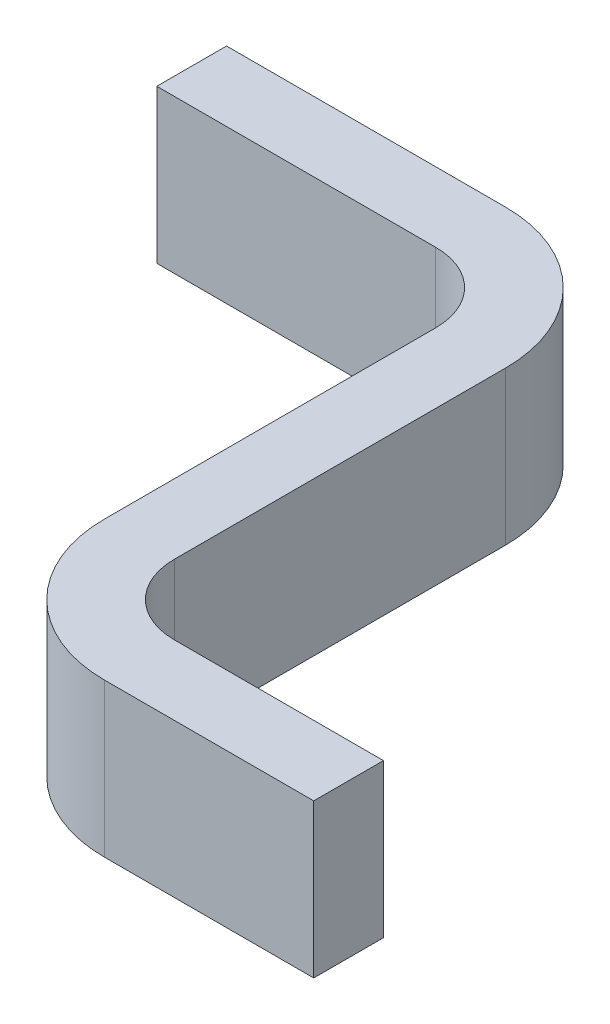
ISO-10303-21;
HEADER;
FILE_DESCRIPTION(('STEP AP214'),'2;1');
FILE_NAME('part.step','',(''),(''),'','','');
FILE_SCHEMA(('AUTOMOTIVE_DESIGN { 1 0 10303 214 1 1 1 1 }'));
ENDSEC;
DATA;
#1=APPLICATION_CONTEXT('core data for automotive mechanical design processes');
#2=APPLICATION_PROTOCOL_DEFINITION('international standard','automotive_design',2000,#1);
#3=PRODUCT_CONTEXT('',#1,'mechanical');
#4=PRODUCT('Part','Part','',(#3));
#5=PRODUCT_RELATED_PRODUCT_CATEGORY('part','',(#4));
#6=PRODUCT_DEFINITION_FORMATION('','',#4);
#7=PRODUCT_DEFINITION_CONTEXT('part definition',#1,'design');
#8=PRODUCT_DEFINITION('design','',#6,#7);
#9=PRODUCT_DEFINITION_SHAPE('','',#8);
#10=(LENGTH_UNIT() NAMED_UNIT(*) SI_UNIT(.MILLI.,.METRE.));
#11=(NAMED_UNIT(*) PLANE_ANGLE_UNIT() SI_UNIT($,.RADIAN.));
#12=(NAMED_UNIT(*) SI_UNIT($,.STERADIAN.) SOLID_ANGLE_UNIT());
#13=UNCERTAINTY_MEASURE_WITH_UNIT(LENGTH_MEASURE(1.E-05),#10,'distance_accuracy_value','');
#14=(GEOMETRIC_REPRESENTATION_CONTEXT(3) GLOBAL_UNCERTAINTY_ASSIGNED_CONTEXT((#13)) GLOBAL_UNIT_ASSIGNED_CONTEXT((#10,
#11,#12)) REPRESENTATION_CONTEXT('',''));
#15=CARTESIAN_POINT('',(0.,0.,0.));
#16=DIRECTION('',(0.,0.,1.));
#17=DIRECTION('',(1.,0.,0.));
#18=AXIS2_PLACEMENT_3D('',#15,#16,#17);
#19=CARTESIAN_POINT('',(-4.,1.86,0.675));
#20=DIRECTION('',(0.,-1.,0.));
#21=DIRECTION('',(1.,0.,0.));
#22=AXIS2_PLACEMENT_3D('',#19,#20,#21);
#23=PLANE('',#22);
#24=CARTESIAN_POINT('',(-3.8,1.86,0.675));
#25=DIRECTION('',(0.,1.,0.));
#26=DIRECTION('',(-1.,0.,0.));
#27=AXIS2_PLACEMENT_3D('',#24,#25,#26);
#28=CIRCLE('',#27,0.2);
#29=CARTESIAN_POINT('',(-3.8,1.86,0.875));
#30=VERTEX_POINT('',#29);
#31=CARTESIAN_POINT('',(-4.,1.86,0.675));
#32=VERTEX_POINT('',#31);
#33=EDGE_CURVE('E150',#30,#32,#28,.F.);
#34=ORIENTED_EDGE('',*,*,#33,.F.);
#35=DIRECTION('',(-1.,0.,0.));
#36=VECTOR('',#35,1.);
#37=CARTESIAN_POINT('',(-3.50000000000001,1.86,0.875));
#38=LINE('',#37,#36);
#39=CARTESIAN_POINT('',(-3.50000000000001,1.86,0.875));
#40=VERTEX_POINT('',#39);
#41=EDGE_CURVE('E147',#30,#40,#38,.F.);
#42=ORIENTED_EDGE('',*,*,#41,.T.);
#43=DIRECTION('',(0.,0.,1.));
#44=VECTOR('',#43,1.);
#45=CARTESIAN_POINT('',(-3.50000000000001,1.86,0.775));
#46=LINE('',#45,#44);
#47=CARTESIAN_POINT('',(-3.50000000000001,1.86,0.775));
#48=VERTEX_POINT('',#47);
#49=EDGE_CURVE('E141',#48,#40,#46,.T.);
#50=ORIENTED_EDGE('',*,*,#49,.F.);
#51=DIRECTION('',(1.,0.,0.));
#52=VECTOR('',#51,1.);
#53=CARTESIAN_POINT('',(-3.50000000000001,1.86,0.775));
#54=LINE('',#53,#52);
#55=CARTESIAN_POINT('',(-3.8,1.86,0.775));
#56=VERTEX_POINT('',#55);
#57=EDGE_CURVE('E115',#48,#56,#54,.F.);
#58=ORIENTED_EDGE('',*,*,#57,.T.);
#59=CARTESIAN_POINT('',(-3.8,1.86,0.675));
#60=DIRECTION('',(0.,1.,0.));
#61=DIRECTION('',(-1.,0.,0.));
#62=AXIS2_PLACEMENT_3D('',#59,#60,#61);
#63=CIRCLE('',#62,0.1);
#64=CARTESIAN_POINT('',(-3.9,1.86,0.675));
#65=VERTEX_POINT('',#64);
#66=EDGE_CURVE('E215',#56,#65,#63,.F.);
#67=ORIENTED_EDGE('',*,*,#66,.T.);
#68=DIRECTION('',(0.,0.,1.));
#69=VECTOR('',#68,1.);
#70=CARTESIAN_POINT('',(-3.9,1.86,0.675));
#71=LINE('',#70,#69);
#72=CARTESIAN_POINT('',(-3.9,1.86,0.2));
#73=VERTEX_POINT('',#72);
#74=EDGE_CURVE('E181',#65,#73,#71,.F.);
#75=ORIENTED_EDGE('',*,*,#74,.T.);
#76=CARTESIAN_POINT('',(-4.1,1.86,0.2));
#77=DIRECTION('',(0.,-1.,0.));
#78=DIRECTION('',(1.,0.,0.));
#79=AXIS2_PLACEMENT_3D('',#76,#77,#78);
#80=CIRCLE('',#79,0.2);
#81=CARTESIAN_POINT('',(-4.1,1.86,0.));
#82=VERTEX_POINT('',#81);
#83=EDGE_CURVE('E20',#82,#73,#80,.T.);
#84=ORIENTED_EDGE('',*,*,#83,.F.);
#85=DIRECTION('',(1.,0.,0.));
#86=VECTOR('',#85,1.);
#87=CARTESIAN_POINT('',(-4.1,1.86,0.));
#88=LINE('',#87,#86);
#89=CARTESIAN_POINT('',(-4.5,1.86,0.));
#90=VERTEX_POINT('',#89);
#91=EDGE_CURVE('E91',#82,#90,#88,.F.);
#92=ORIENTED_EDGE('',*,*,#91,.T.);
#93=DIRECTION('',(0.,0.,1.));
#94=VECTOR('',#93,1.);
#95=CARTESIAN_POINT('',(-4.5,1.86,0.));
#96=LINE('',#95,#94);
#97=CARTESIAN_POINT('',(-4.5,1.86,0.1));
#98=VERTEX_POINT('',#97);
#99=EDGE_CURVE('E163',#90,#98,#96,.T.);
#100=ORIENTED_EDGE('',*,*,#99,.T.);
#101=DIRECTION('',(-1.,0.,0.));
#102=VECTOR('',#101,1.);
#103=CARTESIAN_POINT('',(-4.1,1.86,0.1));
#104=LINE('',#103,#102);
#105=CARTESIAN_POINT('',(-4.1,1.86,0.1));
#106=VERTEX_POINT('',#105);
#107=EDGE_CURVE('E159',#98,#106,#104,.F.);
#108=ORIENTED_EDGE('',*,*,#107,.T.);
#109=CARTESIAN_POINT('',(-4.1,1.86,0.2));
#110=DIRECTION('',(0.,-1.,0.));
#111=DIRECTION('',(1.,0.,0.));
#112=AXIS2_PLACEMENT_3D('',#109,#110,#111);
#113=CIRCLE('',#112,0.1);
#114=CARTESIAN_POINT('',(-4.,1.86,0.2));
#115=VERTEX_POINT('',#114);
#116=EDGE_CURVE('E155',#106,#115,#113,.T.);
#117=ORIENTED_EDGE('',*,*,#116,.T.);
#118=DIRECTION('',(0.,0.,1.));
#119=VECTOR('',#118,1.);
#120=CARTESIAN_POINT('',(-4.,1.86,0.675));
#121=LINE('',#120,#119);
#122=EDGE_CURVE('E154',#115,#32,#121,.T.);
#123=ORIENTED_EDGE('',*,*,#122,.T.);
#124=EDGE_LOOP('',(#34,#42,#50,#58,#67,#75,#84,#92,#100,#108,#117,#123));
#125=FACE_BOUND('',#124,.T.);
#126=ADVANCED_FACE('F17',(#125),#23,.F.);
#127=CARTESIAN_POINT('',(-4.1,1.86,0.2));
#128=DIRECTION('',(0.,-1.,0.));
#129=DIRECTION('',(1.,0.,0.));
#130=AXIS2_PLACEMENT_3D('',#127,#128,#129);
#131=CYLINDRICAL_SURFACE('',#130,0.2);
#132=CARTESIAN_POINT('',(-4.1,1.64,0.2));
#133=DIRECTION('',(0.,-1.,0.));
#134=DIRECTION('',(1.,0.,0.));
#135=AXIS2_PLACEMENT_3D('',#132,#133,#134);
#136=CIRCLE('',#135,0.2);
#137=CARTESIAN_POINT('',(-3.90000000000001,1.64,0.2));
#138=VERTEX_POINT('',#137);
#139=CARTESIAN_POINT('',(-4.1,1.64,0.));
#140=VERTEX_POINT('',#139);
#141=EDGE_CURVE('E183',#138,#140,#136,.F.);
#142=ORIENTED_EDGE('',*,*,#141,.T.);
#143=DIRECTION('',(0.,1.,0.));
#144=VECTOR('',#143,1.);
#145=CARTESIAN_POINT('',(-4.1,1.86,0.));
#146=LINE('',#145,#144);
#147=EDGE_CURVE('E178',#140,#82,#146,.T.);
#148=ORIENTED_EDGE('',*,*,#147,.T.);
#149=ORIENTED_EDGE('',*,*,#83,.T.);
#150=DIRECTION('',(0.,-1.,0.));
#151=VECTOR('',#150,1.);
#152=CARTESIAN_POINT('',(-3.9,1.86,0.2));
#153=LINE('',#152,#151);
#154=EDGE_CURVE('E217',#73,#138,#153,.T.);
#155=ORIENTED_EDGE('',*,*,#154,.T.);
#156=EDGE_LOOP('',(#142,#148,#149,#155));
#157=FACE_BOUND('',#156,.T.);
#158=ADVANCED_FACE('F254',(#157),#131,.T.);
#159=CARTESIAN_POINT('',(-4.1,1.86,0.));
#160=DIRECTION('',(0.,0.,1.));
#161=DIRECTION('',(1.,0.,0.));
#162=AXIS2_PLACEMENT_3D('',#159,#160,#161);
#163=PLANE('',#162);
#164=ORIENTED_EDGE('',*,*,#147,.F.);
#165=DIRECTION('',(-1.,0.,0.));
#166=VECTOR('',#165,1.);
#167=CARTESIAN_POINT('',(-3.90000000000001,1.64,0.));
#168=LINE('',#167,#166);
#169=CARTESIAN_POINT('',(-4.5,1.64,0.));
#170=VERTEX_POINT('',#169);
#171=EDGE_CURVE('E170',#140,#170,#168,.T.);
#172=ORIENTED_EDGE('',*,*,#171,.T.);
#173=DIRECTION('',(0.,1.,0.));
#174=VECTOR('',#173,1.);
#175=CARTESIAN_POINT('',(-4.5,1.86,0.));
#176=LINE('',#175,#174);
#177=EDGE_CURVE('E173',#170,#90,#176,.T.);
#178=ORIENTED_EDGE('',*,*,#177,.T.);
#179=ORIENTED_EDGE('',*,*,#91,.F.);
#180=EDGE_LOOP('',(#164,#172,#178,#179));
#181=FACE_BOUND('',#180,.T.);
#182=ADVANCED_FACE('F257',(#181),#163,.F.);
#183=CARTESIAN_POINT('',(-4.5,1.86,0.));
#184=DIRECTION('',(1.,0.,0.));
#185=DIRECTION('',(0.,1.,0.));
#186=AXIS2_PLACEMENT_3D('',#183,#184,#185);
#187=PLANE('',#186);
#188=DIRECTION('',(0.,1.,0.));
#189=VECTOR('',#188,1.);
#190=CARTESIAN_POINT('',(-4.5,1.64,0.1));
#191=LINE('',#190,#189);
#192=CARTESIAN_POINT('',(-4.5,1.64,0.1));
#193=VERTEX_POINT('',#192);
#194=EDGE_CURVE('E160',#193,#98,#191,.T.);
#195=ORIENTED_EDGE('',*,*,#194,.T.);
#196=ORIENTED_EDGE('',*,*,#99,.F.);
#197=ORIENTED_EDGE('',*,*,#177,.F.);
#198=DIRECTION('',(0.,0.,1.));
#199=VECTOR('',#198,1.);
#200=CARTESIAN_POINT('',(-4.5,1.64,0.675));
#201=LINE('',#200,#199);
#202=EDGE_CURVE('E166',#170,#193,#201,.T.);
#203=ORIENTED_EDGE('',*,*,#202,.T.);
#204=EDGE_LOOP('',(#195,#196,#197,#203));
#205=FACE_BOUND('',#204,.T.);
#206=ADVANCED_FACE('F259',(#205),#187,.F.);
#207=CARTESIAN_POINT('',(-4.1,1.64,0.1));
#208=DIRECTION('',(0.,0.,-1.));
#209=DIRECTION('',(-1.,0.,0.));
#210=AXIS2_PLACEMENT_3D('',#207,#208,#209);
#211=PLANE('',#210);
#212=DIRECTION('',(0.,-1.,0.));
#213=VECTOR('',#212,1.);
#214=CARTESIAN_POINT('',(-4.1,1.64,0.1));
#215=LINE('',#214,#213);
#216=CARTESIAN_POINT('',(-4.1,1.64,0.1));
#217=VERTEX_POINT('',#216);
#218=EDGE_CURVE('E156',#217,#106,#215,.F.);
#219=ORIENTED_EDGE('',*,*,#218,.T.);
#220=ORIENTED_EDGE('',*,*,#107,.F.);
#221=ORIENTED_EDGE('',*,*,#194,.F.);
#222=DIRECTION('',(-1.,0.,0.));
#223=VECTOR('',#222,1.);
#224=CARTESIAN_POINT('',(-3.90000000000001,1.64,0.1));
#225=LINE('',#224,#223);
#226=EDGE_CURVE('E169',#193,#217,#225,.F.);
#227=ORIENTED_EDGE('',*,*,#226,.T.);
#228=EDGE_LOOP('',(#219,#220,#221,#227));
#229=FACE_BOUND('',#228,.T.);
#230=ADVANCED_FACE('F234',(#229),#211,.F.);
#231=CARTESIAN_POINT('',(-4.1,1.64,0.2));
#232=DIRECTION('',(0.,-1.,0.));
#233=DIRECTION('',(1.,0.,0.));
#234=AXIS2_PLACEMENT_3D('',#231,#232,#233);
#235=CYLINDRICAL_SURFACE('',#234,0.1);
#236=DIRECTION('',(0.,1.,0.));
#237=VECTOR('',#236,1.);
#238=CARTESIAN_POINT('',(-4.,1.64,0.2));
#239=LINE('',#238,#237);
#240=CARTESIAN_POINT('',(-4.,1.64,0.2));
#241=VERTEX_POINT('',#240);
#242=EDGE_CURVE('E151',#241,#115,#239,.T.);
#243=ORIENTED_EDGE('',*,*,#242,.T.);
#244=ORIENTED_EDGE('',*,*,#116,.F.);
#245=ORIENTED_EDGE('',*,*,#218,.F.);
#246=CARTESIAN_POINT('',(-4.1,1.64,0.2));
#247=DIRECTION('',(0.,-1.,0.));
#248=DIRECTION('',(1.,0.,0.));
#249=AXIS2_PLACEMENT_3D('',#246,#247,#248);
#250=CIRCLE('',#249,0.1);
#251=EDGE_CURVE('E210',#217,#241,#250,.T.);
#252=ORIENTED_EDGE('',*,*,#251,.T.);
#253=EDGE_LOOP('',(#243,#244,#245,#252));
#254=FACE_BOUND('',#253,.T.);
#255=ADVANCED_FACE('F227',(#254),#235,.F.);
#256=CARTESIAN_POINT('',(-4.,1.64,0.675));
#257=DIRECTION('',(1.,0.,0.));
#258=DIRECTION('',(0.,1.,0.));
#259=AXIS2_PLACEMENT_3D('',#256,#257,#258);
#260=PLANE('',#259);
#261=DIRECTION('',(0.,1.,0.));
#262=VECTOR('',#261,1.);
#263=CARTESIAN_POINT('',(-4.,1.64,0.675));
#264=LINE('',#263,#262);
#265=CARTESIAN_POINT('',(-4.,1.64,0.675));
#266=VERTEX_POINT('',#265);
#267=EDGE_CURVE('E148',#32,#266,#264,.F.);
#268=ORIENTED_EDGE('',*,*,#267,.F.);
#269=ORIENTED_EDGE('',*,*,#122,.F.);
#270=ORIENTED_EDGE('',*,*,#242,.F.);
#271=DIRECTION('',(0.,0.,1.));
#272=VECTOR('',#271,1.);
#273=CARTESIAN_POINT('',(-4.,1.64,0.675));
#274=LINE('',#273,#272);
#275=EDGE_CURVE('E209',#241,#266,#274,.T.);
#276=ORIENTED_EDGE('',*,*,#275,.T.);
#277=EDGE_LOOP('',(#268,#269,#270,#276));
#278=FACE_BOUND('',#277,.T.);
#279=ADVANCED_FACE('F224',(#278),#260,.F.);
#280=CARTESIAN_POINT('',(-3.8,1.64,0.675));
#281=DIRECTION('',(0.,1.,0.));
#282=DIRECTION('',(-1.,0.,0.));
#283=AXIS2_PLACEMENT_3D('',#280,#281,#282);
#284=CYLINDRICAL_SURFACE('',#283,0.2);
#285=ORIENTED_EDGE('',*,*,#33,.T.);
#286=ORIENTED_EDGE('',*,*,#267,.T.);
#287=CARTESIAN_POINT('',(-3.8,1.64,0.675));
#288=DIRECTION('',(0.,1.,0.));
#289=DIRECTION('',(-1.,0.,0.));
#290=AXIS2_PLACEMENT_3D('',#287,#288,#289);
#291=CIRCLE('',#290,0.2);
#292=CARTESIAN_POINT('',(-3.8,1.64,0.875));
#293=VERTEX_POINT('',#292);
#294=EDGE_CURVE('E133',#266,#293,#291,.T.);
#295=ORIENTED_EDGE('',*,*,#294,.T.);
#296=DIRECTION('',(0.,1.,0.));
#297=VECTOR('',#296,1.);
#298=CARTESIAN_POINT('',(-3.8,1.64,0.875));
#299=LINE('',#298,#297);
#300=EDGE_CURVE('E144',#293,#30,#299,.T.);
#301=ORIENTED_EDGE('',*,*,#300,.T.);
#302=EDGE_LOOP('',(#285,#286,#295,#301));
#303=FACE_BOUND('',#302,.T.);
#304=ADVANCED_FACE('F285',(#303),#284,.T.);
#305=CARTESIAN_POINT('',(-3.50000000000001,1.64,0.875));
#306=DIRECTION('',(0.,0.,-1.));
#307=DIRECTION('',(-1.,0.,0.));
#308=AXIS2_PLACEMENT_3D('',#305,#306,#307);
#309=PLANE('',#308);
#310=DIRECTION('',(0.,1.,0.));
#311=VECTOR('',#310,1.);
#312=CARTESIAN_POINT('',(-3.50000000000001,1.86,0.875));
#313=LINE('',#312,#311);
#314=CARTESIAN_POINT('',(-3.50000000000001,1.64,0.875));
#315=VERTEX_POINT('',#314);
#316=EDGE_CURVE('E118',#40,#315,#313,.F.);
#317=ORIENTED_EDGE('',*,*,#316,.F.);
#318=ORIENTED_EDGE('',*,*,#41,.F.);
#319=ORIENTED_EDGE('',*,*,#300,.F.);
#320=DIRECTION('',(-1.,0.,0.));
#321=VECTOR('',#320,1.);
#322=CARTESIAN_POINT('',(-3.90000000000001,1.64,0.875));
#323=LINE('',#322,#321);
#324=EDGE_CURVE('E131',#293,#315,#323,.F.);
#325=ORIENTED_EDGE('',*,*,#324,.T.);
#326=EDGE_LOOP('',(#317,#318,#319,#325));
#327=FACE_BOUND('',#326,.T.);
#328=ADVANCED_FACE('F282',(#327),#309,.F.);
#329=CARTESIAN_POINT('',(-3.50000000000001,1.86,0.775));
#330=DIRECTION('',(1.,0.,0.));
#331=DIRECTION('',(0.,1.,0.));
#332=AXIS2_PLACEMENT_3D('',#329,#330,#331);
#333=PLANE('',#332);
#334=ORIENTED_EDGE('',*,*,#49,.T.);
#335=ORIENTED_EDGE('',*,*,#316,.T.);
#336=DIRECTION('',(0.,0.,1.));
#337=VECTOR('',#336,1.);
#338=CARTESIAN_POINT('',(-3.50000000000001,1.64,0.675));
#339=LINE('',#338,#337);
#340=CARTESIAN_POINT('',(-3.50000000000001,1.64,0.775));
#341=VERTEX_POINT('',#340);
#342=EDGE_CURVE('E125',#315,#341,#339,.F.);
#343=ORIENTED_EDGE('',*,*,#342,.T.);
#344=DIRECTION('',(0.,1.,0.));
#345=VECTOR('',#344,1.);
#346=CARTESIAN_POINT('',(-3.50000000000001,1.86,0.775));
#347=LINE('',#346,#345);
#348=EDGE_CURVE('E110',#341,#48,#347,.T.);
#349=ORIENTED_EDGE('',*,*,#348,.T.);
#350=EDGE_LOOP('',(#334,#335,#343,#349));
#351=FACE_BOUND('',#350,.T.);
#352=ADVANCED_FACE('F129',(#351),#333,.T.);
#353=CARTESIAN_POINT('',(-3.50000000000001,1.86,0.775));
#354=DIRECTION('',(0.,0.,1.));
#355=DIRECTION('',(1.,0.,0.));
#356=AXIS2_PLACEMENT_3D('',#353,#354,#355);
#357=PLANE('',#356);
#358=ORIENTED_EDGE('',*,*,#348,.F.);
#359=DIRECTION('',(-1.,0.,0.));
#360=VECTOR('',#359,1.);
#361=CARTESIAN_POINT('',(-3.90000000000001,1.64,0.775));
#362=LINE('',#361,#360);
#363=CARTESIAN_POINT('',(-3.8,1.64,0.775));
#364=VERTEX_POINT('',#363);
#365=EDGE_CURVE('E114',#341,#364,#362,.T.);
#366=ORIENTED_EDGE('',*,*,#365,.T.);
#367=DIRECTION('',(0.,1.,0.));
#368=VECTOR('',#367,1.);
#369=CARTESIAN_POINT('',(-3.8,1.86,0.775));
#370=LINE('',#369,#368);
#371=EDGE_CURVE('E185',#364,#56,#370,.T.);
#372=ORIENTED_EDGE('',*,*,#371,.T.);
#373=ORIENTED_EDGE('',*,*,#57,.F.);
#374=EDGE_LOOP('',(#358,#366,#372,#373));
#375=FACE_BOUND('',#374,.T.);
#376=ADVANCED_FACE('F112',(#375),#357,.F.);
#377=CARTESIAN_POINT('',(-3.8,1.86,0.675));
#378=DIRECTION('',(0.,1.,0.));
#379=DIRECTION('',(-1.,0.,0.));
#380=AXIS2_PLACEMENT_3D('',#377,#378,#379);
#381=CYLINDRICAL_SURFACE('',#380,0.1);
#382=ORIENTED_EDGE('',*,*,#371,.F.);
#383=CARTESIAN_POINT('',(-3.8,1.64,0.675));
#384=DIRECTION('',(0.,1.,0.));
#385=DIRECTION('',(-1.,0.,0.));
#386=AXIS2_PLACEMENT_3D('',#383,#384,#385);
#387=CIRCLE('',#386,0.1);
#388=CARTESIAN_POINT('',(-3.90000000000001,1.64,0.675));
#389=VERTEX_POINT('',#388);
#390=EDGE_CURVE('E26',#364,#389,#387,.F.);
#391=ORIENTED_EDGE('',*,*,#390,.T.);
#392=DIRECTION('',(0.,-1.,0.));
#393=VECTOR('',#392,1.);
#394=CARTESIAN_POINT('',(-3.9,1.86,0.675));
#395=LINE('',#394,#393);
#396=EDGE_CURVE('E34',#389,#65,#395,.F.);
#397=ORIENTED_EDGE('',*,*,#396,.T.);
#398=ORIENTED_EDGE('',*,*,#66,.F.);
#399=EDGE_LOOP('',(#382,#391,#397,#398));
#400=FACE_BOUND('',#399,.T.);
#401=ADVANCED_FACE('F250',(#400),#381,.F.);
#402=CARTESIAN_POINT('',(-3.9,1.86,0.675));
#403=DIRECTION('',(-1.,0.,0.));
#404=DIRECTION('',(0.,-1.,0.));
#405=AXIS2_PLACEMENT_3D('',#402,#403,#404);
#406=PLANE('',#405);
#407=ORIENTED_EDGE('',*,*,#396,.F.);
#408=DIRECTION('',(0.,0.,1.));
#409=VECTOR('',#408,1.);
#410=CARTESIAN_POINT('',(-3.90000000000001,1.64,0.675));
#411=LINE('',#410,#409);
#412=EDGE_CURVE('E11',#389,#138,#411,.F.);
#413=ORIENTED_EDGE('',*,*,#412,.T.);
#414=ORIENTED_EDGE('',*,*,#154,.F.);
#415=ORIENTED_EDGE('',*,*,#74,.F.);
#416=EDGE_LOOP('',(#407,#413,#414,#415));
#417=FACE_BOUND('',#416,.T.);
#418=ADVANCED_FACE('F252',(#417),#406,.F.);
#419=CARTESIAN_POINT('',(-3.90000000000001,1.64,0.675));
#420=DIRECTION('',(0.,1.,0.));
#421=DIRECTION('',(-1.,0.,0.));
#422=AXIS2_PLACEMENT_3D('',#419,#420,#421);
#423=PLANE('',#422);
#424=ORIENTED_EDGE('',*,*,#390,.F.);
#425=ORIENTED_EDGE('',*,*,#365,.F.);
#426=ORIENTED_EDGE('',*,*,#342,.F.);
#427=ORIENTED_EDGE('',*,*,#324,.F.);
#428=ORIENTED_EDGE('',*,*,#294,.F.);
#429=ORIENTED_EDGE('',*,*,#275,.F.);
#430=ORIENTED_EDGE('',*,*,#251,.F.);
#431=ORIENTED_EDGE('',*,*,#226,.F.);
#432=ORIENTED_EDGE('',*,*,#202,.F.);
#433=ORIENTED_EDGE('',*,*,#171,.F.);
#434=ORIENTED_EDGE('',*,*,#141,.F.);
#435=ORIENTED_EDGE('',*,*,#412,.F.);
#436=EDGE_LOOP('',(#424,#425,#426,#427,#428,#429,#430,#431,#432,#433,#434,#435));
#437=FACE_BOUND('',#436,.T.);
#438=ADVANCED_FACE('F123',(#437),#423,.F.);
#439=CLOSED_SHELL('',(#126,#158,#182,#206,#230,#255,#279,#304,#328,#352,#376,#401,#418,#438));
#440=MANIFOLD_SOLID_BREP('B1',#439);
#441=ADVANCED_BREP_SHAPE_REPRESENTATION('',(#18,#440),#14);
#442=SHAPE_DEFINITION_REPRESENTATION(#9,#441);
ENDSEC;
END-ISO-10303-21;
